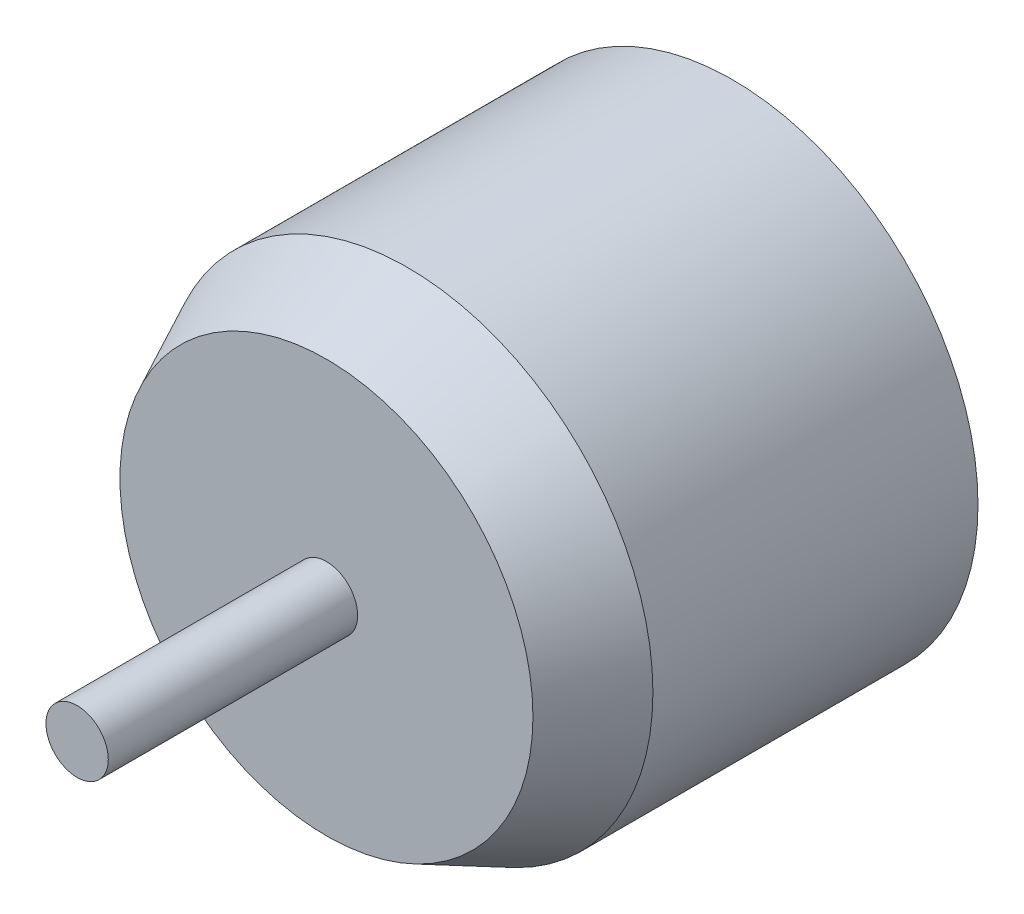
ISO-10303-21;
HEADER;
FILE_DESCRIPTION(('STEP AP214'),'2;1');
FILE_NAME('part.step','',(''),(''),'','','');
FILE_SCHEMA(('AUTOMOTIVE_DESIGN { 1 0 10303 214 1 1 1 1 }'));
ENDSEC;
DATA;
#1=APPLICATION_CONTEXT('core data for automotive mechanical design processes');
#2=APPLICATION_PROTOCOL_DEFINITION('international standard','automotive_design',2000,#1);
#3=PRODUCT_CONTEXT('',#1,'mechanical');
#4=PRODUCT('Part','Part','',(#3));
#5=PRODUCT_RELATED_PRODUCT_CATEGORY('part','',(#4));
#6=PRODUCT_DEFINITION_FORMATION('','',#4);
#7=PRODUCT_DEFINITION_CONTEXT('part definition',#1,'design');
#8=PRODUCT_DEFINITION('design','',#6,#7);
#9=PRODUCT_DEFINITION_SHAPE('','',#8);
#10=(LENGTH_UNIT() NAMED_UNIT(*) SI_UNIT(.MILLI.,.METRE.));
#11=(NAMED_UNIT(*) PLANE_ANGLE_UNIT() SI_UNIT($,.RADIAN.));
#12=(NAMED_UNIT(*) SI_UNIT($,.STERADIAN.) SOLID_ANGLE_UNIT());
#13=UNCERTAINTY_MEASURE_WITH_UNIT(LENGTH_MEASURE(1.E-05),#10,'distance_accuracy_value','');
#14=(GEOMETRIC_REPRESENTATION_CONTEXT(3) GLOBAL_UNCERTAINTY_ASSIGNED_CONTEXT((#13)) GLOBAL_UNIT_ASSIGNED_CONTEXT((#10,
#11,#12)) REPRESENTATION_CONTEXT('',''));
#15=CARTESIAN_POINT('',(0.,0.,0.));
#16=DIRECTION('',(0.,0.,1.));
#17=DIRECTION('',(1.,0.,0.));
#18=AXIS2_PLACEMENT_3D('',#15,#16,#17);
#19=CARTESIAN_POINT('',(0.,4.,102.752853447374));
#20=DIRECTION('',(0.,0.,-1.));
#21=DIRECTION('',(-1.,0.,0.));
#22=AXIS2_PLACEMENT_3D('',#19,#20,#21);
#23=PLANE('',#22);
#24=CARTESIAN_POINT('',(0.,0.,102.752853447374));
#25=DIRECTION('',(0.,0.,1.));
#26=DIRECTION('',(1.,0.,0.));
#27=AXIS2_PLACEMENT_3D('',#24,#25,#26);
#28=CIRCLE('',#27,4.);
#29=CARTESIAN_POINT('',(4.,0.,102.752853447374));
#30=VERTEX_POINT('',#29);
#31=EDGE_CURVE('E53',#30,#30,#28,.T.);
#32=ORIENTED_EDGE('',*,*,#31,.T.);
#33=EDGE_LOOP('',(#32));
#34=FACE_BOUND('',#33,.T.);
#35=ADVANCED_FACE('F31',(#34),#23,.F.);
#36=CARTESIAN_POINT('',(0.,0.,15.7528534473738));
#37=DIRECTION('',(0.,0.,1.));
#38=DIRECTION('',(1.,0.,0.));
#39=AXIS2_PLACEMENT_3D('',#36,#37,#38);
#40=PLANE('',#39);
#41=CARTESIAN_POINT('',(0.,0.,15.7528534473738));
#42=DIRECTION('',(0.,0.,1.));
#43=DIRECTION('',(1.,0.,0.));
#44=AXIS2_PLACEMENT_3D('',#41,#42,#43);
#45=CIRCLE('',#44,22.2915705923619);
#46=CARTESIAN_POINT('',(22.2915705923619,0.,15.7528534473738));
#47=VERTEX_POINT('',#46);
#48=EDGE_CURVE('E10',#47,#47,#45,.T.);
#49=ORIENTED_EDGE('',*,*,#48,.F.);
#50=EDGE_LOOP('',(#49));
#51=FACE_BOUND('',#50,.T.);
#52=ADVANCED_FACE('F83',(#51),#40,.F.);
#53=CARTESIAN_POINT('',(0.,0.,15.7528534473738));
#54=DIRECTION('',(0.,0.,1.));
#55=DIRECTION('',(1.,0.,0.));
#56=AXIS2_PLACEMENT_3D('',#53,#54,#55);
#57=CONICAL_SURFACE('',#56,22.2915705923619,1.26698807074087);
#58=CARTESIAN_POINT('',(0.,0.,18.6398236503962));
#59=DIRECTION('',(0.,0.,1.));
#60=DIRECTION('',(1.,0.,0.));
#61=AXIS2_PLACEMENT_3D('',#58,#59,#60);
#62=CIRCLE('',#61,31.5);
#63=CARTESIAN_POINT('',(31.5,0.,18.6398236503962));
#64=VERTEX_POINT('',#63);
#65=EDGE_CURVE('E37',#64,#64,#62,.T.);
#66=ORIENTED_EDGE('',*,*,#65,.F.);
#67=EDGE_LOOP('',(#66));
#68=FACE_BOUND('',#67,.T.);
#69=ORIENTED_EDGE('',*,*,#48,.T.);
#70=EDGE_LOOP('',(#69));
#71=FACE_BOUND('',#70,.T.);
#72=ADVANCED_FACE('F78',(#68,#71),#57,.T.);
#73=CARTESIAN_POINT('',(0.,0.,164.609375));
#74=DIRECTION('',(0.,0.,1.));
#75=DIRECTION('',(1.,0.,0.));
#76=AXIS2_PLACEMENT_3D('',#73,#74,#75);
#77=CYLINDRICAL_SURFACE('',#76,31.5);
#78=CARTESIAN_POINT('',(0.,0.,60.3587174311653));
#79=DIRECTION('',(0.,0.,1.));
#80=DIRECTION('',(1.,0.,0.));
#81=AXIS2_PLACEMENT_3D('',#78,#79,#80);
#82=CIRCLE('',#81,31.5);
#83=CARTESIAN_POINT('',(31.5,0.,60.3587174311653));
#84=VERTEX_POINT('',#83);
#85=EDGE_CURVE('E41',#84,#84,#82,.T.);
#86=ORIENTED_EDGE('',*,*,#85,.F.);
#87=EDGE_LOOP('',(#86));
#88=FACE_BOUND('',#87,.T.);
#89=ORIENTED_EDGE('',*,*,#65,.T.);
#90=EDGE_LOOP('',(#89));
#91=FACE_BOUND('',#90,.T.);
#92=ADVANCED_FACE('F73',(#88,#91),#77,.T.);
#93=CARTESIAN_POINT('',(0.,0.,60.3587174311653));
#94=DIRECTION('',(0.,0.,-1.));
#95=DIRECTION('',(-1.,0.,0.));
#96=AXIS2_PLACEMENT_3D('',#93,#94,#95);
#97=CONICAL_SURFACE('',#96,31.5,0.448485291227763);
#98=CARTESIAN_POINT('',(0.,0.,70.7528534473738));
#99=DIRECTION('',(0.,0.,1.));
#100=DIRECTION('',(1.,0.,0.));
#101=AXIS2_PLACEMENT_3D('',#98,#99,#100);
#102=CIRCLE('',#101,26.4984636113894);
#103=CARTESIAN_POINT('',(26.4984636113894,0.,70.7528534473738));
#104=VERTEX_POINT('',#103);
#105=EDGE_CURVE('E45',#104,#104,#102,.T.);
#106=ORIENTED_EDGE('',*,*,#105,.F.);
#107=EDGE_LOOP('',(#106));
#108=FACE_BOUND('',#107,.T.);
#109=ORIENTED_EDGE('',*,*,#85,.T.);
#110=EDGE_LOOP('',(#109));
#111=FACE_BOUND('',#110,.T.);
#112=ADVANCED_FACE('F67',(#108,#111),#97,.T.);
#113=CARTESIAN_POINT('',(0.,26.4984636113894,70.7528534473738));
#114=DIRECTION('',(0.,0.,-1.));
#115=DIRECTION('',(-1.,0.,0.));
#116=AXIS2_PLACEMENT_3D('',#113,#114,#115);
#117=PLANE('',#116);
#118=CARTESIAN_POINT('',(0.,0.,70.7528534473738));
#119=DIRECTION('',(0.,0.,1.));
#120=DIRECTION('',(1.,0.,0.));
#121=AXIS2_PLACEMENT_3D('',#118,#119,#120);
#122=CIRCLE('',#121,4.);
#123=CARTESIAN_POINT('',(4.,0.,70.7528534473738));
#124=VERTEX_POINT('',#123);
#125=EDGE_CURVE('E50',#124,#124,#122,.T.);
#126=ORIENTED_EDGE('',*,*,#125,.F.);
#127=EDGE_LOOP('',(#126));
#128=FACE_BOUND('',#127,.T.);
#129=ORIENTED_EDGE('',*,*,#105,.T.);
#130=EDGE_LOOP('',(#129));
#131=FACE_BOUND('',#130,.T.);
#132=ADVANCED_FACE('F61',(#128,#131),#117,.F.);
#133=CARTESIAN_POINT('',(0.,0.,164.609375));
#134=DIRECTION('',(0.,0.,1.));
#135=DIRECTION('',(1.,0.,0.));
#136=AXIS2_PLACEMENT_3D('',#133,#134,#135);
#137=CYLINDRICAL_SURFACE('',#136,4.);
#138=ORIENTED_EDGE('',*,*,#31,.F.);
#139=EDGE_LOOP('',(#138));
#140=FACE_BOUND('',#139,.T.);
#141=ORIENTED_EDGE('',*,*,#125,.T.);
#142=EDGE_LOOP('',(#141));
#143=FACE_BOUND('',#142,.T.);
#144=ADVANCED_FACE('F58',(#140,#143),#137,.T.);
#145=CLOSED_SHELL('',(#35,#52,#72,#92,#112,#132,#144));
#146=MANIFOLD_SOLID_BREP('B2',#145);
#147=ADVANCED_BREP_SHAPE_REPRESENTATION('',(#18,#146),#14);
#148=SHAPE_DEFINITION_REPRESENTATION(#9,#147);
ENDSEC;
END-ISO-10303-21;
